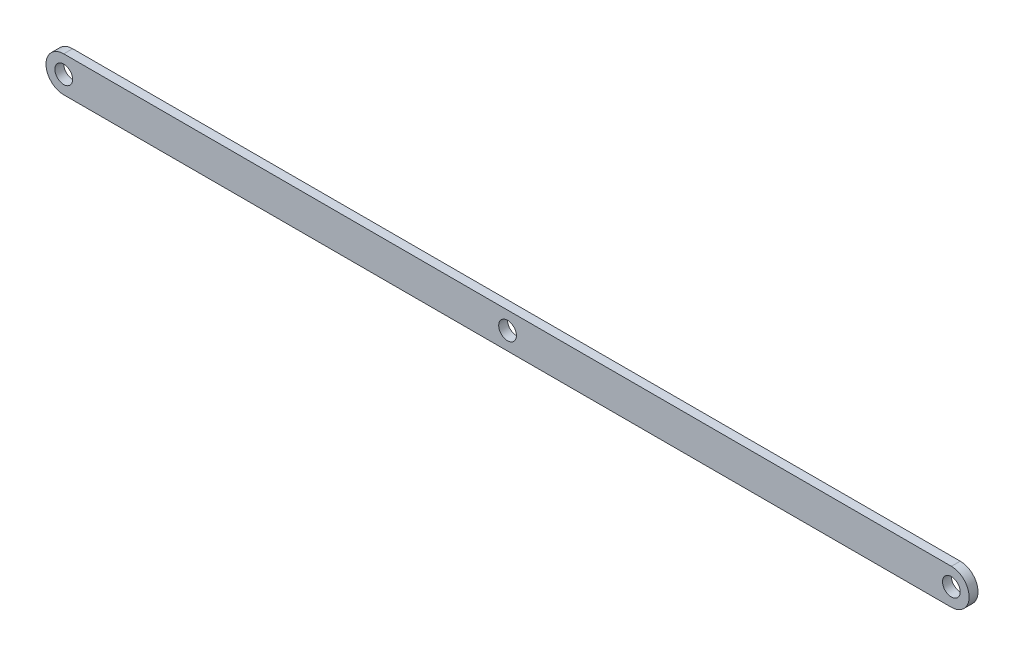
ISO-10303-21;
HEADER;
FILE_DESCRIPTION(('STEP AP214'),'2;1');
FILE_NAME('part.step','',(''),(''),'','','');
FILE_SCHEMA(('AUTOMOTIVE_DESIGN { 1 0 10303 214 1 1 1 1 }'));
ENDSEC;
DATA;
#1=APPLICATION_CONTEXT('core data for automotive mechanical design processes');
#2=APPLICATION_PROTOCOL_DEFINITION('international standard','automotive_design',2000,#1);
#3=PRODUCT_CONTEXT('',#1,'mechanical');
#4=PRODUCT('Part','Part','',(#3));
#5=PRODUCT_RELATED_PRODUCT_CATEGORY('part','',(#4));
#6=PRODUCT_DEFINITION_FORMATION('','',#4);
#7=PRODUCT_DEFINITION_CONTEXT('part definition',#1,'design');
#8=PRODUCT_DEFINITION('design','',#6,#7);
#9=PRODUCT_DEFINITION_SHAPE('','',#8);
#10=(LENGTH_UNIT() NAMED_UNIT(*) SI_UNIT(.MILLI.,.METRE.));
#11=(NAMED_UNIT(*) PLANE_ANGLE_UNIT() SI_UNIT($,.RADIAN.));
#12=(NAMED_UNIT(*) SI_UNIT($,.STERADIAN.) SOLID_ANGLE_UNIT());
#13=UNCERTAINTY_MEASURE_WITH_UNIT(LENGTH_MEASURE(1.E-05),#10,'distance_accuracy_value','');
#14=(GEOMETRIC_REPRESENTATION_CONTEXT(3) GLOBAL_UNCERTAINTY_ASSIGNED_CONTEXT((#13)) GLOBAL_UNIT_ASSIGNED_CONTEXT((#10,
#11,#12)) REPRESENTATION_CONTEXT('',''));
#15=CARTESIAN_POINT('',(0.,0.,0.));
#16=DIRECTION('',(0.,0.,1.));
#17=DIRECTION('',(1.,0.,0.));
#18=AXIS2_PLACEMENT_3D('',#15,#16,#17);
#19=CARTESIAN_POINT('',(-250.,0.,5.));
#20=DIRECTION('',(0.,0.,1.));
#21=DIRECTION('',(1.,0.,0.));
#22=AXIS2_PLACEMENT_3D('',#19,#20,#21);
#23=PLANE('',#22);
#24=CARTESIAN_POINT('',(250.,0.,5.));
#25=DIRECTION('',(0.,0.,1.));
#26=DIRECTION('',(1.,0.,0.));
#27=AXIS2_PLACEMENT_3D('',#24,#25,#26);
#28=CIRCLE('',#27,4.99999999999999);
#29=CARTESIAN_POINT('',(255.,0.,5.));
#30=VERTEX_POINT('',#29);
#31=EDGE_CURVE('E138',#30,#30,#28,.T.);
#32=ORIENTED_EDGE('',*,*,#31,.F.);
#33=EDGE_LOOP('',(#32));
#34=FACE_BOUND('',#33,.T.);
#35=CARTESIAN_POINT('',(-250.,0.,5.));
#36=DIRECTION('',(0.,0.,1.));
#37=DIRECTION('',(1.,0.,0.));
#38=AXIS2_PLACEMENT_3D('',#35,#36,#37);
#39=CIRCLE('',#38,10.);
#40=CARTESIAN_POINT('',(-250.,9.99999999999999,5.));
#41=VERTEX_POINT('',#40);
#42=CARTESIAN_POINT('',(-250.,-10.,5.));
#43=VERTEX_POINT('',#42);
#44=EDGE_CURVE('E96',#41,#43,#39,.T.);
#45=ORIENTED_EDGE('',*,*,#44,.T.);
#46=DIRECTION('',(1.,0.,0.));
#47=VECTOR('',#46,1.);
#48=CARTESIAN_POINT('',(-250.,-10.,5.));
#49=LINE('',#48,#47);
#50=CARTESIAN_POINT('',(250.,-10.,5.));
#51=VERTEX_POINT('',#50);
#52=EDGE_CURVE('E91',#43,#51,#49,.T.);
#53=ORIENTED_EDGE('',*,*,#52,.T.);
#54=CARTESIAN_POINT('',(250.,0.,5.));
#55=DIRECTION('',(0.,0.,1.));
#56=DIRECTION('',(1.,0.,0.));
#57=AXIS2_PLACEMENT_3D('',#54,#55,#56);
#58=CIRCLE('',#57,10.);
#59=CARTESIAN_POINT('',(250.,10.0000000000001,5.));
#60=VERTEX_POINT('',#59);
#61=EDGE_CURVE('E94',#51,#60,#58,.T.);
#62=ORIENTED_EDGE('',*,*,#61,.T.);
#63=DIRECTION('',(-1.,0.,0.));
#64=VECTOR('',#63,1.);
#65=CARTESIAN_POINT('',(-250.,9.99999999999999,5.));
#66=LINE('',#65,#64);
#67=EDGE_CURVE('E61',#60,#41,#66,.T.);
#68=ORIENTED_EDGE('',*,*,#67,.T.);
#69=EDGE_LOOP('',(#45,#53,#62,#68));
#70=FACE_BOUND('',#69,.T.);
#71=CARTESIAN_POINT('',(-250.,0.,5.));
#72=DIRECTION('',(0.,0.,1.));
#73=DIRECTION('',(1.,0.,0.));
#74=AXIS2_PLACEMENT_3D('',#71,#72,#73);
#75=CIRCLE('',#74,4.99999999999999);
#76=CARTESIAN_POINT('',(-245.,0.,5.));
#77=VERTEX_POINT('',#76);
#78=EDGE_CURVE('E116',#77,#77,#75,.T.);
#79=ORIENTED_EDGE('',*,*,#78,.F.);
#80=EDGE_LOOP('',(#79));
#81=FACE_BOUND('',#80,.T.);
#82=CARTESIAN_POINT('',(0.,0.,5.));
#83=DIRECTION('',(0.,0.,1.));
#84=DIRECTION('',(1.,0.,0.));
#85=AXIS2_PLACEMENT_3D('',#82,#83,#84);
#86=CIRCLE('',#85,5.);
#87=CARTESIAN_POINT('',(5.,0.,5.));
#88=VERTEX_POINT('',#87);
#89=EDGE_CURVE('E146',#88,#88,#86,.T.);
#90=ORIENTED_EDGE('',*,*,#89,.F.);
#91=EDGE_LOOP('',(#90));
#92=FACE_BOUND('',#91,.T.);
#93=ADVANCED_FACE('F43',(#34,#70,#81,#92),#23,.T.);
#94=CARTESIAN_POINT('',(-250.,0.,0.));
#95=DIRECTION('',(0.,0.,1.));
#96=DIRECTION('',(1.,0.,0.));
#97=AXIS2_PLACEMENT_3D('',#94,#95,#96);
#98=PLANE('',#97);
#99=CARTESIAN_POINT('',(-250.,0.,0.));
#100=DIRECTION('',(0.,0.,1.));
#101=DIRECTION('',(1.,0.,0.));
#102=AXIS2_PLACEMENT_3D('',#99,#100,#101);
#103=CIRCLE('',#102,10.);
#104=CARTESIAN_POINT('',(-250.,9.99999999999999,0.));
#105=VERTEX_POINT('',#104);
#106=CARTESIAN_POINT('',(-250.,-10.,0.));
#107=VERTEX_POINT('',#106);
#108=EDGE_CURVE('E112',#105,#107,#103,.T.);
#109=ORIENTED_EDGE('',*,*,#108,.F.);
#110=DIRECTION('',(-1.,0.,0.));
#111=VECTOR('',#110,1.);
#112=CARTESIAN_POINT('',(-250.,9.99999999999999,0.));
#113=LINE('',#112,#111);
#114=CARTESIAN_POINT('',(250.,10.0000000000001,0.));
#115=VERTEX_POINT('',#114);
#116=EDGE_CURVE('E84',#115,#105,#113,.T.);
#117=ORIENTED_EDGE('',*,*,#116,.F.);
#118=CARTESIAN_POINT('',(250.,0.,0.));
#119=DIRECTION('',(0.,0.,1.));
#120=DIRECTION('',(1.,0.,0.));
#121=AXIS2_PLACEMENT_3D('',#118,#119,#120);
#122=CIRCLE('',#121,10.);
#123=CARTESIAN_POINT('',(250.,-10.,0.));
#124=VERTEX_POINT('',#123);
#125=EDGE_CURVE('E78',#124,#115,#122,.T.);
#126=ORIENTED_EDGE('',*,*,#125,.F.);
#127=DIRECTION('',(1.,0.,0.));
#128=VECTOR('',#127,1.);
#129=CARTESIAN_POINT('',(-250.,-10.,0.));
#130=LINE('',#129,#128);
#131=EDGE_CURVE('E101',#107,#124,#130,.T.);
#132=ORIENTED_EDGE('',*,*,#131,.F.);
#133=EDGE_LOOP('',(#109,#117,#126,#132));
#134=FACE_BOUND('',#133,.T.);
#135=CARTESIAN_POINT('',(-250.,0.,0.));
#136=DIRECTION('',(0.,0.,1.));
#137=DIRECTION('',(1.,0.,0.));
#138=AXIS2_PLACEMENT_3D('',#135,#136,#137);
#139=CIRCLE('',#138,4.99999999999999);
#140=CARTESIAN_POINT('',(-245.,0.,0.));
#141=VERTEX_POINT('',#140);
#142=EDGE_CURVE('E134',#141,#141,#139,.T.);
#143=ORIENTED_EDGE('',*,*,#142,.T.);
#144=EDGE_LOOP('',(#143));
#145=FACE_BOUND('',#144,.T.);
#146=CARTESIAN_POINT('',(250.,0.,0.));
#147=DIRECTION('',(0.,0.,1.));
#148=DIRECTION('',(1.,0.,0.));
#149=AXIS2_PLACEMENT_3D('',#146,#147,#148);
#150=CIRCLE('',#149,4.99999999999999);
#151=CARTESIAN_POINT('',(255.,0.,0.));
#152=VERTEX_POINT('',#151);
#153=EDGE_CURVE('E142',#152,#152,#150,.T.);
#154=ORIENTED_EDGE('',*,*,#153,.T.);
#155=EDGE_LOOP('',(#154));
#156=FACE_BOUND('',#155,.T.);
#157=CARTESIAN_POINT('',(0.,0.,0.));
#158=DIRECTION('',(0.,0.,1.));
#159=DIRECTION('',(1.,0.,0.));
#160=AXIS2_PLACEMENT_3D('',#157,#158,#159);
#161=CIRCLE('',#160,5.);
#162=CARTESIAN_POINT('',(5.,0.,0.));
#163=VERTEX_POINT('',#162);
#164=EDGE_CURVE('E150',#163,#163,#161,.T.);
#165=ORIENTED_EDGE('',*,*,#164,.T.);
#166=EDGE_LOOP('',(#165));
#167=FACE_BOUND('',#166,.T.);
#168=ADVANCED_FACE('F129',(#134,#145,#156,#167),#98,.F.);
#169=CARTESIAN_POINT('',(-250.,0.,5.));
#170=DIRECTION('',(0.,0.,-1.));
#171=DIRECTION('',(-1.,0.,0.));
#172=AXIS2_PLACEMENT_3D('',#169,#170,#171);
#173=CYLINDRICAL_SURFACE('',#172,10.);
#174=ORIENTED_EDGE('',*,*,#108,.T.);
#175=DIRECTION('',(0.,0.,-1.));
#176=VECTOR('',#175,1.);
#177=CARTESIAN_POINT('',(-250.,-10.,5.));
#178=LINE('',#177,#176);
#179=EDGE_CURVE('E11',#43,#107,#178,.T.);
#180=ORIENTED_EDGE('',*,*,#179,.F.);
#181=ORIENTED_EDGE('',*,*,#44,.F.);
#182=DIRECTION('',(0.,0.,-1.));
#183=VECTOR('',#182,1.);
#184=CARTESIAN_POINT('',(-250.,9.99999999999999,5.));
#185=LINE('',#184,#183);
#186=EDGE_CURVE('E108',#41,#105,#185,.T.);
#187=ORIENTED_EDGE('',*,*,#186,.T.);
#188=EDGE_LOOP('',(#174,#180,#181,#187));
#189=FACE_BOUND('',#188,.T.);
#190=ADVANCED_FACE('F45',(#189),#173,.T.);
#191=CARTESIAN_POINT('',(-250.,-10.,5.));
#192=DIRECTION('',(0.,1.,0.));
#193=DIRECTION('',(0.,0.,1.));
#194=AXIS2_PLACEMENT_3D('',#191,#192,#193);
#195=PLANE('',#194);
#196=ORIENTED_EDGE('',*,*,#131,.T.);
#197=DIRECTION('',(0.,0.,-1.));
#198=VECTOR('',#197,1.);
#199=CARTESIAN_POINT('',(250.,-10.,5.));
#200=LINE('',#199,#198);
#201=EDGE_CURVE('E53',#51,#124,#200,.T.);
#202=ORIENTED_EDGE('',*,*,#201,.F.);
#203=ORIENTED_EDGE('',*,*,#52,.F.);
#204=ORIENTED_EDGE('',*,*,#179,.T.);
#205=EDGE_LOOP('',(#196,#202,#203,#204));
#206=FACE_BOUND('',#205,.T.);
#207=ADVANCED_FACE('F100',(#206),#195,.F.);
#208=CARTESIAN_POINT('',(250.,0.,5.));
#209=DIRECTION('',(0.,0.,-1.));
#210=DIRECTION('',(-1.,0.,0.));
#211=AXIS2_PLACEMENT_3D('',#208,#209,#210);
#212=CYLINDRICAL_SURFACE('',#211,10.);
#213=ORIENTED_EDGE('',*,*,#125,.T.);
#214=DIRECTION('',(0.,0.,-1.));
#215=VECTOR('',#214,1.);
#216=CARTESIAN_POINT('',(250.,10.0000000000001,5.));
#217=LINE('',#216,#215);
#218=EDGE_CURVE('E103',#60,#115,#217,.T.);
#219=ORIENTED_EDGE('',*,*,#218,.F.);
#220=ORIENTED_EDGE('',*,*,#61,.F.);
#221=ORIENTED_EDGE('',*,*,#201,.T.);
#222=EDGE_LOOP('',(#213,#219,#220,#221));
#223=FACE_BOUND('',#222,.T.);
#224=ADVANCED_FACE('F104',(#223),#212,.T.);
#225=CARTESIAN_POINT('',(-250.,9.99999999999999,5.));
#226=DIRECTION('',(0.,-1.,0.));
#227=DIRECTION('',(1.,0.,0.));
#228=AXIS2_PLACEMENT_3D('',#225,#226,#227);
#229=PLANE('',#228);
#230=ORIENTED_EDGE('',*,*,#116,.T.);
#231=ORIENTED_EDGE('',*,*,#186,.F.);
#232=ORIENTED_EDGE('',*,*,#67,.F.);
#233=ORIENTED_EDGE('',*,*,#218,.T.);
#234=EDGE_LOOP('',(#230,#231,#232,#233));
#235=FACE_BOUND('',#234,.T.);
#236=ADVANCED_FACE('F126',(#235),#229,.F.);
#237=CARTESIAN_POINT('',(-250.,0.,5.));
#238=DIRECTION('',(0.,0.,-1.));
#239=DIRECTION('',(-1.,0.,0.));
#240=AXIS2_PLACEMENT_3D('',#237,#238,#239);
#241=CYLINDRICAL_SURFACE('',#240,4.99999999999999);
#242=ORIENTED_EDGE('',*,*,#78,.T.);
#243=EDGE_LOOP('',(#242));
#244=FACE_BOUND('',#243,.T.);
#245=ORIENTED_EDGE('',*,*,#142,.F.);
#246=EDGE_LOOP('',(#245));
#247=FACE_BOUND('',#246,.T.);
#248=ADVANCED_FACE('F170',(#244,#247),#241,.F.);
#249=CARTESIAN_POINT('',(250.,0.,5.));
#250=DIRECTION('',(0.,0.,-1.));
#251=DIRECTION('',(-1.,0.,0.));
#252=AXIS2_PLACEMENT_3D('',#249,#250,#251);
#253=CYLINDRICAL_SURFACE('',#252,4.99999999999999);
#254=ORIENTED_EDGE('',*,*,#31,.T.);
#255=EDGE_LOOP('',(#254));
#256=FACE_BOUND('',#255,.T.);
#257=ORIENTED_EDGE('',*,*,#153,.F.);
#258=EDGE_LOOP('',(#257));
#259=FACE_BOUND('',#258,.T.);
#260=ADVANCED_FACE('F224',(#256,#259),#253,.F.);
#261=CARTESIAN_POINT('',(0.,0.,5.));
#262=DIRECTION('',(0.,0.,-1.));
#263=DIRECTION('',(-1.,0.,0.));
#264=AXIS2_PLACEMENT_3D('',#261,#262,#263);
#265=CYLINDRICAL_SURFACE('',#264,5.);
#266=ORIENTED_EDGE('',*,*,#89,.T.);
#267=EDGE_LOOP('',(#266));
#268=FACE_BOUND('',#267,.T.);
#269=ORIENTED_EDGE('',*,*,#164,.F.);
#270=EDGE_LOOP('',(#269));
#271=FACE_BOUND('',#270,.T.);
#272=ADVANCED_FACE('F158',(#268,#271),#265,.F.);
#273=CLOSED_SHELL('',(#93,#168,#190,#207,#224,#236,#248,#260,#272));
#274=MANIFOLD_SOLID_BREP('B2',#273);
#275=ADVANCED_BREP_SHAPE_REPRESENTATION('',(#18,#274),#14);
#276=SHAPE_DEFINITION_REPRESENTATION(#9,#275);
ENDSEC;
END-ISO-10303-21;
